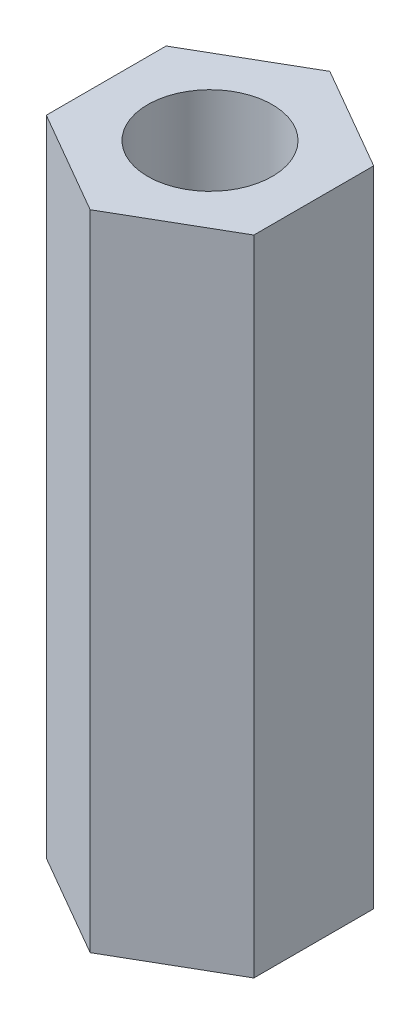
ISO-10303-21;
HEADER;
FILE_DESCRIPTION(('STEP AP214'),'2;1');
FILE_NAME('part.step','',(''),(''),'','','');
FILE_SCHEMA(('AUTOMOTIVE_DESIGN { 1 0 10303 214 1 1 1 1 }'));
ENDSEC;
DATA;
#1=APPLICATION_CONTEXT('core data for automotive mechanical design processes');
#2=APPLICATION_PROTOCOL_DEFINITION('international standard','automotive_design',2000,#1);
#3=PRODUCT_CONTEXT('',#1,'mechanical');
#4=PRODUCT('Part','Part','',(#3));
#5=PRODUCT_RELATED_PRODUCT_CATEGORY('part','',(#4));
#6=PRODUCT_DEFINITION_FORMATION('','',#4);
#7=PRODUCT_DEFINITION_CONTEXT('part definition',#1,'design');
#8=PRODUCT_DEFINITION('design','',#6,#7);
#9=PRODUCT_DEFINITION_SHAPE('','',#8);
#10=(LENGTH_UNIT() NAMED_UNIT(*) SI_UNIT(.MILLI.,.METRE.));
#11=(NAMED_UNIT(*) PLANE_ANGLE_UNIT() SI_UNIT($,.RADIAN.));
#12=(NAMED_UNIT(*) SI_UNIT($,.STERADIAN.) SOLID_ANGLE_UNIT());
#13=UNCERTAINTY_MEASURE_WITH_UNIT(LENGTH_MEASURE(1.E-05),#10,'distance_accuracy_value','');
#14=(GEOMETRIC_REPRESENTATION_CONTEXT(3) GLOBAL_UNCERTAINTY_ASSIGNED_CONTEXT((#13)) GLOBAL_UNIT_ASSIGNED_CONTEXT((#10,
#11,#12)) REPRESENTATION_CONTEXT('',''));
#15=CARTESIAN_POINT('',(0.,0.,0.));
#16=DIRECTION('',(0.,0.,1.));
#17=DIRECTION('',(1.,0.,0.));
#18=AXIS2_PLACEMENT_3D('',#15,#16,#17);
#19=CARTESIAN_POINT('',(0.,15.5,0.));
#20=DIRECTION('',(0.,1.,0.));
#21=DIRECTION('',(0.,0.,1.));
#22=AXIS2_PLACEMENT_3D('',#19,#20,#21);
#23=PLANE('',#22);
#24=DIRECTION('',(-0.866025403784439,0.,-0.5));
#25=VECTOR('',#24,1.);
#26=CARTESIAN_POINT('',(2.5,15.5,-1.44337567297407));
#27=LINE('',#26,#25);
#28=CARTESIAN_POINT('',(2.5,15.5,-1.44337567297407));
#29=VERTEX_POINT('',#28);
#30=CARTESIAN_POINT('',(0.,15.5,-2.88675134594813));
#31=VERTEX_POINT('',#30);
#32=EDGE_CURVE('E129',#29,#31,#27,.T.);
#33=ORIENTED_EDGE('',*,*,#32,.T.);
#34=DIRECTION('',(-0.866025403784439,0.,0.5));
#35=VECTOR('',#34,1.);
#36=CARTESIAN_POINT('',(0.,15.5,-2.88675134594813));
#37=LINE('',#36,#35);
#38=CARTESIAN_POINT('',(-2.5,15.5,-1.44337567297407));
#39=VERTEX_POINT('',#38);
#40=EDGE_CURVE('E87',#31,#39,#37,.T.);
#41=ORIENTED_EDGE('',*,*,#40,.T.);
#42=DIRECTION('',(0.,0.,1.));
#43=VECTOR('',#42,1.);
#44=CARTESIAN_POINT('',(-2.5,15.5,-1.44337567297407));
#45=LINE('',#44,#43);
#46=CARTESIAN_POINT('',(-2.5,15.5,1.44337567297406));
#47=VERTEX_POINT('',#46);
#48=EDGE_CURVE('E100',#39,#47,#45,.T.);
#49=ORIENTED_EDGE('',*,*,#48,.T.);
#50=DIRECTION('',(0.866025403784439,0.,0.5));
#51=VECTOR('',#50,1.);
#52=CARTESIAN_POINT('',(-2.5,15.5,1.44337567297406));
#53=LINE('',#52,#51);
#54=CARTESIAN_POINT('',(0.,15.5,2.88675134594813));
#55=VERTEX_POINT('',#54);
#56=EDGE_CURVE('E94',#47,#55,#53,.T.);
#57=ORIENTED_EDGE('',*,*,#56,.T.);
#58=DIRECTION('',(0.866025403784439,0.,-0.5));
#59=VECTOR('',#58,1.);
#60=CARTESIAN_POINT('',(0.,15.5,2.88675134594813));
#61=LINE('',#60,#59);
#62=CARTESIAN_POINT('',(2.5,15.5,1.44337567297407));
#63=VERTEX_POINT('',#62);
#64=EDGE_CURVE('E98',#55,#63,#61,.T.);
#65=ORIENTED_EDGE('',*,*,#64,.T.);
#66=DIRECTION('',(0.,0.,-1.));
#67=VECTOR('',#66,1.);
#68=CARTESIAN_POINT('',(2.5,15.5,1.44337567297407));
#69=LINE('',#68,#67);
#70=EDGE_CURVE('E50',#63,#29,#69,.T.);
#71=ORIENTED_EDGE('',*,*,#70,.T.);
#72=EDGE_LOOP('',(#33,#41,#49,#57,#65,#71));
#73=FACE_BOUND('',#72,.T.);
#74=CARTESIAN_POINT('',(0.,15.5,0.));
#75=DIRECTION('',(0.,1.,0.));
#76=DIRECTION('',(0.,0.,1.));
#77=AXIS2_PLACEMENT_3D('',#74,#75,#76);
#78=CIRCLE('',#77,1.5);
#79=CARTESIAN_POINT('',(0.,15.5,1.5));
#80=VERTEX_POINT('',#79);
#81=EDGE_CURVE('E122',#80,#80,#78,.T.);
#82=ORIENTED_EDGE('',*,*,#81,.F.);
#83=EDGE_LOOP('',(#82));
#84=FACE_BOUND('',#83,.T.);
#85=ADVANCED_FACE('F33',(#73,#84),#23,.T.);
#86=CARTESIAN_POINT('',(0.,0.,0.));
#87=DIRECTION('',(0.,1.,0.));
#88=DIRECTION('',(0.,0.,1.));
#89=AXIS2_PLACEMENT_3D('',#86,#87,#88);
#90=PLANE('',#89);
#91=DIRECTION('',(-0.866025403784439,0.,-0.5));
#92=VECTOR('',#91,1.);
#93=CARTESIAN_POINT('',(2.5,0.,-1.44337567297407));
#94=LINE('',#93,#92);
#95=CARTESIAN_POINT('',(2.5,0.,-1.44337567297407));
#96=VERTEX_POINT('',#95);
#97=CARTESIAN_POINT('',(0.,0.,-2.88675134594813));
#98=VERTEX_POINT('',#97);
#99=EDGE_CURVE('E118',#96,#98,#94,.T.);
#100=ORIENTED_EDGE('',*,*,#99,.F.);
#101=DIRECTION('',(0.,0.,-1.));
#102=VECTOR('',#101,1.);
#103=CARTESIAN_POINT('',(2.5,0.,1.44337567297407));
#104=LINE('',#103,#102);
#105=CARTESIAN_POINT('',(2.5,0.,1.44337567297407));
#106=VERTEX_POINT('',#105);
#107=EDGE_CURVE('E79',#106,#96,#104,.T.);
#108=ORIENTED_EDGE('',*,*,#107,.F.);
#109=DIRECTION('',(0.866025403784439,0.,-0.5));
#110=VECTOR('',#109,1.);
#111=CARTESIAN_POINT('',(0.,0.,2.88675134594813));
#112=LINE('',#111,#110);
#113=CARTESIAN_POINT('',(0.,0.,2.88675134594813));
#114=VERTEX_POINT('',#113);
#115=EDGE_CURVE('E73',#114,#106,#112,.T.);
#116=ORIENTED_EDGE('',*,*,#115,.F.);
#117=DIRECTION('',(0.866025403784439,0.,0.5));
#118=VECTOR('',#117,1.);
#119=CARTESIAN_POINT('',(-2.5,0.,1.44337567297406));
#120=LINE('',#119,#118);
#121=CARTESIAN_POINT('',(-2.5,0.,1.44337567297406));
#122=VERTEX_POINT('',#121);
#123=EDGE_CURVE('E108',#122,#114,#120,.T.);
#124=ORIENTED_EDGE('',*,*,#123,.F.);
#125=DIRECTION('',(0.,0.,1.));
#126=VECTOR('',#125,1.);
#127=CARTESIAN_POINT('',(-2.5,0.,-1.44337567297407));
#128=LINE('',#127,#126);
#129=CARTESIAN_POINT('',(-2.5,0.,-1.44337567297407));
#130=VERTEX_POINT('',#129);
#131=EDGE_CURVE('E124',#130,#122,#128,.T.);
#132=ORIENTED_EDGE('',*,*,#131,.F.);
#133=DIRECTION('',(-0.866025403784439,0.,0.5));
#134=VECTOR('',#133,1.);
#135=CARTESIAN_POINT('',(0.,0.,-2.88675134594813));
#136=LINE('',#135,#134);
#137=EDGE_CURVE('E121',#98,#130,#136,.T.);
#138=ORIENTED_EDGE('',*,*,#137,.F.);
#139=EDGE_LOOP('',(#100,#108,#116,#124,#132,#138));
#140=FACE_BOUND('',#139,.T.);
#141=CARTESIAN_POINT('',(0.,0.,0.));
#142=DIRECTION('',(0.,1.,0.));
#143=DIRECTION('',(0.,0.,1.));
#144=AXIS2_PLACEMENT_3D('',#141,#142,#143);
#145=CIRCLE('',#144,1.5);
#146=CARTESIAN_POINT('',(0.,0.,1.5));
#147=VERTEX_POINT('',#146);
#148=EDGE_CURVE('E222',#147,#147,#145,.T.);
#149=ORIENTED_EDGE('',*,*,#148,.T.);
#150=EDGE_LOOP('',(#149));
#151=FACE_BOUND('',#150,.T.);
#152=ADVANCED_FACE('F138',(#140,#151),#90,.F.);
#153=CARTESIAN_POINT('',(2.5,15.5,-1.44337567297407));
#154=DIRECTION('',(-0.5,0.,0.866025403784439));
#155=DIRECTION('',(0.866025403784439,0.,0.5));
#156=AXIS2_PLACEMENT_3D('',#153,#154,#155);
#157=PLANE('',#156);
#158=ORIENTED_EDGE('',*,*,#99,.T.);
#159=DIRECTION('',(0.,-1.,0.));
#160=VECTOR('',#159,1.);
#161=CARTESIAN_POINT('',(0.,15.5,-2.88675134594813));
#162=LINE('',#161,#160);
#163=EDGE_CURVE('E11',#31,#98,#162,.T.);
#164=ORIENTED_EDGE('',*,*,#163,.F.);
#165=ORIENTED_EDGE('',*,*,#32,.F.);
#166=DIRECTION('',(0.,-1.,0.));
#167=VECTOR('',#166,1.);
#168=CARTESIAN_POINT('',(2.5,15.5,-1.44337567297407));
#169=LINE('',#168,#167);
#170=EDGE_CURVE('E114',#29,#96,#169,.T.);
#171=ORIENTED_EDGE('',*,*,#170,.T.);
#172=EDGE_LOOP('',(#158,#164,#165,#171));
#173=FACE_BOUND('',#172,.T.);
#174=ADVANCED_FACE('F35',(#173),#157,.F.);
#175=CARTESIAN_POINT('',(0.,15.5,-2.88675134594813));
#176=DIRECTION('',(0.5,0.,0.866025403784439));
#177=DIRECTION('',(0.866025403784439,0.,-0.5));
#178=AXIS2_PLACEMENT_3D('',#175,#176,#177);
#179=PLANE('',#178);
#180=ORIENTED_EDGE('',*,*,#137,.T.);
#181=DIRECTION('',(0.,-1.,0.));
#182=VECTOR('',#181,1.);
#183=CARTESIAN_POINT('',(-2.5,15.5,-1.44337567297407));
#184=LINE('',#183,#182);
#185=EDGE_CURVE('E42',#39,#130,#184,.T.);
#186=ORIENTED_EDGE('',*,*,#185,.F.);
#187=ORIENTED_EDGE('',*,*,#40,.F.);
#188=ORIENTED_EDGE('',*,*,#163,.T.);
#189=EDGE_LOOP('',(#180,#186,#187,#188));
#190=FACE_BOUND('',#189,.T.);
#191=ADVANCED_FACE('F163',(#190),#179,.F.);
#192=CARTESIAN_POINT('',(-2.5,15.5,-1.44337567297407));
#193=DIRECTION('',(1.,0.,0.));
#194=DIRECTION('',(0.,0.,-1.));
#195=AXIS2_PLACEMENT_3D('',#192,#193,#194);
#196=PLANE('',#195);
#197=ORIENTED_EDGE('',*,*,#131,.T.);
#198=DIRECTION('',(0.,-1.,0.));
#199=VECTOR('',#198,1.);
#200=CARTESIAN_POINT('',(-2.5,15.5,1.44337567297406));
#201=LINE('',#200,#199);
#202=EDGE_CURVE('E109',#47,#122,#201,.T.);
#203=ORIENTED_EDGE('',*,*,#202,.F.);
#204=ORIENTED_EDGE('',*,*,#48,.F.);
#205=ORIENTED_EDGE('',*,*,#185,.T.);
#206=EDGE_LOOP('',(#197,#203,#204,#205));
#207=FACE_BOUND('',#206,.T.);
#208=ADVANCED_FACE('F135',(#207),#196,.F.);
#209=CARTESIAN_POINT('',(-2.5,15.5,1.44337567297406));
#210=DIRECTION('',(0.5,0.,-0.866025403784439));
#211=DIRECTION('',(-0.866025403784439,0.,-0.5));
#212=AXIS2_PLACEMENT_3D('',#209,#210,#211);
#213=PLANE('',#212);
#214=ORIENTED_EDGE('',*,*,#123,.T.);
#215=DIRECTION('',(0.,-1.,0.));
#216=VECTOR('',#215,1.);
#217=CARTESIAN_POINT('',(0.,15.5,2.88675134594813));
#218=LINE('',#217,#216);
#219=EDGE_CURVE('E105',#55,#114,#218,.T.);
#220=ORIENTED_EDGE('',*,*,#219,.F.);
#221=ORIENTED_EDGE('',*,*,#56,.F.);
#222=ORIENTED_EDGE('',*,*,#202,.T.);
#223=EDGE_LOOP('',(#214,#220,#221,#222));
#224=FACE_BOUND('',#223,.T.);
#225=ADVANCED_FACE('F106',(#224),#213,.F.);
#226=CARTESIAN_POINT('',(0.,15.5,2.88675134594813));
#227=DIRECTION('',(-0.5,0.,-0.866025403784439));
#228=DIRECTION('',(-0.866025403784439,0.,0.5));
#229=AXIS2_PLACEMENT_3D('',#226,#227,#228);
#230=PLANE('',#229);
#231=ORIENTED_EDGE('',*,*,#115,.T.);
#232=DIRECTION('',(0.,-1.,0.));
#233=VECTOR('',#232,1.);
#234=CARTESIAN_POINT('',(2.5,15.5,1.44337567297407));
#235=LINE('',#234,#233);
#236=EDGE_CURVE('E110',#63,#106,#235,.T.);
#237=ORIENTED_EDGE('',*,*,#236,.F.);
#238=ORIENTED_EDGE('',*,*,#64,.F.);
#239=ORIENTED_EDGE('',*,*,#219,.T.);
#240=EDGE_LOOP('',(#231,#237,#238,#239));
#241=FACE_BOUND('',#240,.T.);
#242=ADVANCED_FACE('F112',(#241),#230,.F.);
#243=CARTESIAN_POINT('',(2.5,15.5,1.44337567297407));
#244=DIRECTION('',(-1.,0.,0.));
#245=DIRECTION('',(0.,0.,1.));
#246=AXIS2_PLACEMENT_3D('',#243,#244,#245);
#247=PLANE('',#246);
#248=ORIENTED_EDGE('',*,*,#107,.T.);
#249=ORIENTED_EDGE('',*,*,#170,.F.);
#250=ORIENTED_EDGE('',*,*,#70,.F.);
#251=ORIENTED_EDGE('',*,*,#236,.T.);
#252=EDGE_LOOP('',(#248,#249,#250,#251));
#253=FACE_BOUND('',#252,.T.);
#254=ADVANCED_FACE('F143',(#253),#247,.F.);
#255=CARTESIAN_POINT('',(0.,15.5,0.));
#256=DIRECTION('',(0.,-1.,0.));
#257=DIRECTION('',(0.,0.,-1.));
#258=AXIS2_PLACEMENT_3D('',#255,#256,#257);
#259=CYLINDRICAL_SURFACE('',#258,1.5);
#260=ORIENTED_EDGE('',*,*,#81,.T.);
#261=EDGE_LOOP('',(#260));
#262=FACE_BOUND('',#261,.T.);
#263=ORIENTED_EDGE('',*,*,#148,.F.);
#264=EDGE_LOOP('',(#263));
#265=FACE_BOUND('',#264,.T.);
#266=ADVANCED_FACE('F145',(#262,#265),#259,.F.);
#267=CLOSED_SHELL('',(#85,#152,#174,#191,#208,#225,#242,#254,#266));
#268=MANIFOLD_SOLID_BREP('B2',#267);
#269=ADVANCED_BREP_SHAPE_REPRESENTATION('',(#18,#268),#14);
#270=SHAPE_DEFINITION_REPRESENTATION(#9,#269);
ENDSEC;
END-ISO-10303-21;
